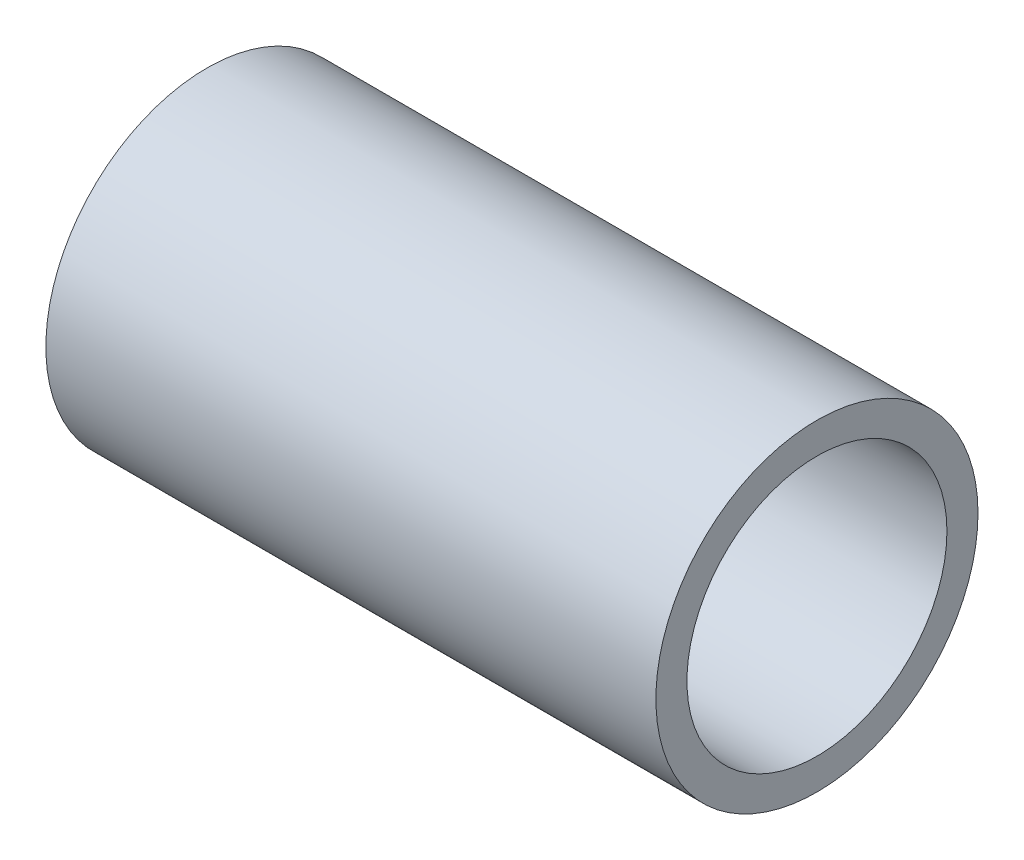
ISO-10303-21;
HEADER;
FILE_DESCRIPTION(('STEP AP214'),'2;1');
FILE_NAME('part.step','',(''),(''),'','','');
FILE_SCHEMA(('AUTOMOTIVE_DESIGN { 1 0 10303 214 1 1 1 1 }'));
ENDSEC;
DATA;
#1=APPLICATION_CONTEXT('core data for automotive mechanical design processes');
#2=APPLICATION_PROTOCOL_DEFINITION('international standard','automotive_design',2000,#1);
#3=PRODUCT_CONTEXT('',#1,'mechanical');
#4=PRODUCT('Part','Part','',(#3));
#5=PRODUCT_RELATED_PRODUCT_CATEGORY('part','',(#4));
#6=PRODUCT_DEFINITION_FORMATION('','',#4);
#7=PRODUCT_DEFINITION_CONTEXT('part definition',#1,'design');
#8=PRODUCT_DEFINITION('design','',#6,#7);
#9=PRODUCT_DEFINITION_SHAPE('','',#8);
#10=(LENGTH_UNIT() NAMED_UNIT(*) SI_UNIT(.MILLI.,.METRE.));
#11=(NAMED_UNIT(*) PLANE_ANGLE_UNIT() SI_UNIT($,.RADIAN.));
#12=(NAMED_UNIT(*) SI_UNIT($,.STERADIAN.) SOLID_ANGLE_UNIT());
#13=UNCERTAINTY_MEASURE_WITH_UNIT(LENGTH_MEASURE(1.E-05),#10,'distance_accuracy_value','');
#14=(GEOMETRIC_REPRESENTATION_CONTEXT(3) GLOBAL_UNCERTAINTY_ASSIGNED_CONTEXT((#13)) GLOBAL_UNIT_ASSIGNED_CONTEXT((#10,
#11,#12)) REPRESENTATION_CONTEXT('',''));
#15=CARTESIAN_POINT('',(0.,0.,0.));
#16=DIRECTION('',(0.,0.,1.));
#17=DIRECTION('',(1.,0.,0.));
#18=AXIS2_PLACEMENT_3D('',#15,#16,#17);
#19=CARTESIAN_POINT('',(31.75,0.,0.));
#20=DIRECTION('',(1.,0.,0.));
#21=DIRECTION('',(0.,0.,-1.));
#22=AXIS2_PLACEMENT_3D('',#19,#20,#21);
#23=PLANE('',#22);
#24=CARTESIAN_POINT('',(31.75,0.,0.));
#25=DIRECTION('',(1.,0.,0.));
#26=DIRECTION('',(0.,0.,-1.));
#27=AXIS2_PLACEMENT_3D('',#24,#25,#26);
#28=CIRCLE('',#27,8.382);
#29=CARTESIAN_POINT('',(31.75,0.,-8.382));
#30=VERTEX_POINT('',#29);
#31=EDGE_CURVE('E10',#30,#30,#28,.T.);
#32=ORIENTED_EDGE('',*,*,#31,.T.);
#33=EDGE_LOOP('',(#32));
#34=FACE_BOUND('',#33,.T.);
#35=CARTESIAN_POINT('',(31.75,0.,0.));
#36=DIRECTION('',(1.,0.,0.));
#37=DIRECTION('',(0.,0.,-1.));
#38=AXIS2_PLACEMENT_3D('',#35,#36,#37);
#39=CIRCLE('',#38,6.765925);
#40=CARTESIAN_POINT('',(31.75,0.,-6.765925));
#41=VERTEX_POINT('',#40);
#42=EDGE_CURVE('E47',#41,#41,#39,.T.);
#43=ORIENTED_EDGE('',*,*,#42,.F.);
#44=EDGE_LOOP('',(#43));
#45=FACE_BOUND('',#44,.T.);
#46=ADVANCED_FACE('F35',(#34,#45),#23,.T.);
#47=CARTESIAN_POINT('',(0.,0.,0.));
#48=DIRECTION('',(1.,0.,0.));
#49=DIRECTION('',(0.,0.,-1.));
#50=AXIS2_PLACEMENT_3D('',#47,#48,#49);
#51=PLANE('',#50);
#52=CARTESIAN_POINT('',(0.,0.,0.));
#53=DIRECTION('',(1.,0.,0.));
#54=DIRECTION('',(0.,0.,-1.));
#55=AXIS2_PLACEMENT_3D('',#52,#53,#54);
#56=CIRCLE('',#55,8.382);
#57=CARTESIAN_POINT('',(0.,0.,-8.382));
#58=VERTEX_POINT('',#57);
#59=EDGE_CURVE('E39',#58,#58,#56,.T.);
#60=ORIENTED_EDGE('',*,*,#59,.F.);
#61=EDGE_LOOP('',(#60));
#62=FACE_BOUND('',#61,.T.);
#63=CARTESIAN_POINT('',(0.,0.,0.));
#64=DIRECTION('',(1.,0.,0.));
#65=DIRECTION('',(0.,0.,-1.));
#66=AXIS2_PLACEMENT_3D('',#63,#64,#65);
#67=CIRCLE('',#66,6.765925);
#68=CARTESIAN_POINT('',(0.,0.,-6.765925));
#69=VERTEX_POINT('',#68);
#70=EDGE_CURVE('E49',#69,#69,#67,.T.);
#71=ORIENTED_EDGE('',*,*,#70,.T.);
#72=EDGE_LOOP('',(#71));
#73=FACE_BOUND('',#72,.T.);
#74=ADVANCED_FACE('F60',(#62,#73),#51,.F.);
#75=CARTESIAN_POINT('',(31.75,0.,0.));
#76=DIRECTION('',(-1.,0.,0.));
#77=DIRECTION('',(0.,0.,1.));
#78=AXIS2_PLACEMENT_3D('',#75,#76,#77);
#79=CYLINDRICAL_SURFACE('',#78,8.382);
#80=ORIENTED_EDGE('',*,*,#31,.F.);
#81=EDGE_LOOP('',(#80));
#82=FACE_BOUND('',#81,.T.);
#83=ORIENTED_EDGE('',*,*,#59,.T.);
#84=EDGE_LOOP('',(#83));
#85=FACE_BOUND('',#84,.T.);
#86=ADVANCED_FACE('F37',(#82,#85),#79,.T.);
#87=CARTESIAN_POINT('',(31.75,0.,0.));
#88=DIRECTION('',(-1.,0.,0.));
#89=DIRECTION('',(0.,0.,1.));
#90=AXIS2_PLACEMENT_3D('',#87,#88,#89);
#91=CYLINDRICAL_SURFACE('',#90,6.765925);
#92=ORIENTED_EDGE('',*,*,#42,.T.);
#93=EDGE_LOOP('',(#92));
#94=FACE_BOUND('',#93,.T.);
#95=ORIENTED_EDGE('',*,*,#70,.F.);
#96=EDGE_LOOP('',(#95));
#97=FACE_BOUND('',#96,.T.);
#98=ADVANCED_FACE('F56',(#94,#97),#91,.F.);
#99=CLOSED_SHELL('',(#46,#74,#86,#98));
#100=MANIFOLD_SOLID_BREP('B2',#99);
#101=ADVANCED_BREP_SHAPE_REPRESENTATION('',(#18,#100),#14);
#102=SHAPE_DEFINITION_REPRESENTATION(#9,#101);
ENDSEC;
END-ISO-10303-21;
